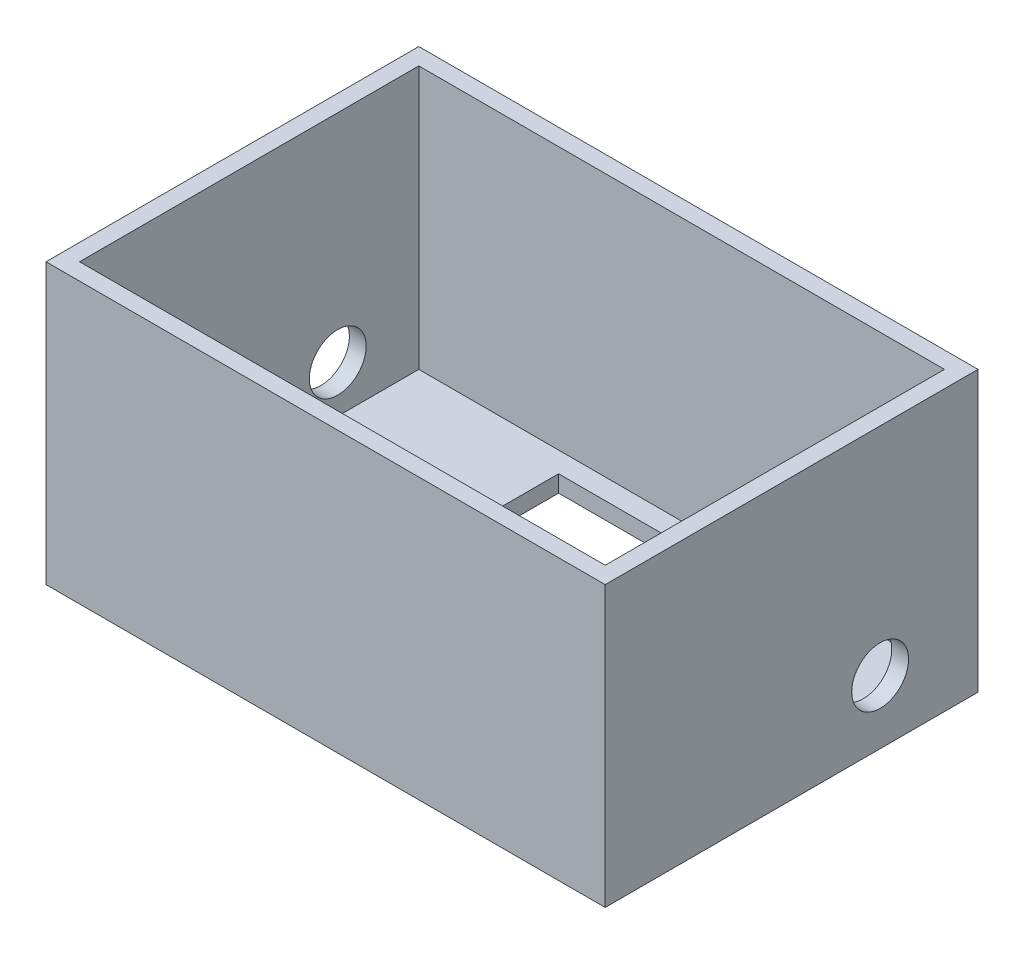
ISO-10303-21;
HEADER;
FILE_DESCRIPTION(('STEP AP214'),'2;1');
FILE_NAME('part.step','',(''),(''),'','','');
FILE_SCHEMA(('AUTOMOTIVE_DESIGN { 1 0 10303 214 1 1 1 1 }'));
ENDSEC;
DATA;
#1=APPLICATION_CONTEXT('core data for automotive mechanical design processes');
#2=APPLICATION_PROTOCOL_DEFINITION('international standard','automotive_design',2000,#1);
#3=PRODUCT_CONTEXT('',#1,'mechanical');
#4=PRODUCT('Part','Part','',(#3));
#5=PRODUCT_RELATED_PRODUCT_CATEGORY('part','',(#4));
#6=PRODUCT_DEFINITION_FORMATION('','',#4);
#7=PRODUCT_DEFINITION_CONTEXT('part definition',#1,'design');
#8=PRODUCT_DEFINITION('design','',#6,#7);
#9=PRODUCT_DEFINITION_SHAPE('','',#8);
#10=(LENGTH_UNIT() NAMED_UNIT(*) SI_UNIT(.MILLI.,.METRE.));
#11=(NAMED_UNIT(*) PLANE_ANGLE_UNIT() SI_UNIT($,.RADIAN.));
#12=(NAMED_UNIT(*) SI_UNIT($,.STERADIAN.) SOLID_ANGLE_UNIT());
#13=UNCERTAINTY_MEASURE_WITH_UNIT(LENGTH_MEASURE(1.E-05),#10,'distance_accuracy_value','');
#14=(GEOMETRIC_REPRESENTATION_CONTEXT(3) GLOBAL_UNCERTAINTY_ASSIGNED_CONTEXT((#13)) GLOBAL_UNIT_ASSIGNED_CONTEXT((#10,
#11,#12)) REPRESENTATION_CONTEXT('',''));
#15=CARTESIAN_POINT('',(0.,0.,0.));
#16=DIRECTION('',(0.,0.,1.));
#17=DIRECTION('',(1.,0.,0.));
#18=AXIS2_PLACEMENT_3D('',#15,#16,#17);
#19=CARTESIAN_POINT('',(0.,30.,0.));
#20=DIRECTION('',(0.,1.,0.));
#21=DIRECTION('',(0.,0.,1.));
#22=AXIS2_PLACEMENT_3D('',#19,#20,#21);
#23=PLANE('',#22);
#24=DIRECTION('',(1.,0.,0.));
#25=VECTOR('',#24,1.);
#26=CARTESIAN_POINT('',(0.,30.,-40.));
#27=LINE('',#26,#25);
#28=CARTESIAN_POINT('',(0.,30.,-40.));
#29=VERTEX_POINT('',#28);
#30=CARTESIAN_POINT('',(60.,30.,-40.));
#31=VERTEX_POINT('',#30);
#32=EDGE_CURVE('E186',#29,#31,#27,.T.);
#33=ORIENTED_EDGE('',*,*,#32,.F.);
#34=DIRECTION('',(0.,0.,-1.));
#35=VECTOR('',#34,1.);
#36=CARTESIAN_POINT('',(0.,30.,0.));
#37=LINE('',#36,#35);
#38=CARTESIAN_POINT('',(0.,30.,0.));
#39=VERTEX_POINT('',#38);
#40=EDGE_CURVE('E194',#39,#29,#37,.T.);
#41=ORIENTED_EDGE('',*,*,#40,.F.);
#42=DIRECTION('',(1.,0.,0.));
#43=VECTOR('',#42,1.);
#44=CARTESIAN_POINT('',(0.,30.,0.));
#45=LINE('',#44,#43);
#46=CARTESIAN_POINT('',(60.,30.,0.));
#47=VERTEX_POINT('',#46);
#48=EDGE_CURVE('E192',#39,#47,#45,.T.);
#49=ORIENTED_EDGE('',*,*,#48,.T.);
#50=DIRECTION('',(0.,0.,-1.));
#51=VECTOR('',#50,1.);
#52=CARTESIAN_POINT('',(60.,30.,0.));
#53=LINE('',#52,#51);
#54=EDGE_CURVE('E189',#47,#31,#53,.T.);
#55=ORIENTED_EDGE('',*,*,#54,.T.);
#56=EDGE_LOOP('',(#33,#41,#49,#55));
#57=FACE_BOUND('',#56,.T.);
#58=DIRECTION('',(0.,0.,-1.));
#59=VECTOR('',#58,1.);
#60=CARTESIAN_POINT('',(1.8,30.,0.));
#61=LINE('',#60,#59);
#62=CARTESIAN_POINT('',(1.8,30.,-1.8));
#63=VERTEX_POINT('',#62);
#64=CARTESIAN_POINT('',(1.79999999999999,30.,-38.2));
#65=VERTEX_POINT('',#64);
#66=EDGE_CURVE('E165',#63,#65,#61,.T.);
#67=ORIENTED_EDGE('',*,*,#66,.T.);
#68=DIRECTION('',(1.,0.,0.));
#69=VECTOR('',#68,1.);
#70=CARTESIAN_POINT('',(0.,30.,-38.2));
#71=LINE('',#70,#69);
#72=CARTESIAN_POINT('',(58.2,30.,-38.2));
#73=VERTEX_POINT('',#72);
#74=EDGE_CURVE('E169',#65,#73,#71,.T.);
#75=ORIENTED_EDGE('',*,*,#74,.T.);
#76=DIRECTION('',(0.,0.,-1.));
#77=VECTOR('',#76,1.);
#78=CARTESIAN_POINT('',(58.2,30.,0.));
#79=LINE('',#78,#77);
#80=CARTESIAN_POINT('',(58.2,30.,-1.8));
#81=VERTEX_POINT('',#80);
#82=EDGE_CURVE('E179',#81,#73,#79,.T.);
#83=ORIENTED_EDGE('',*,*,#82,.F.);
#84=DIRECTION('',(1.,0.,0.));
#85=VECTOR('',#84,1.);
#86=CARTESIAN_POINT('',(0.,30.,-1.8));
#87=LINE('',#86,#85);
#88=EDGE_CURVE('E182',#63,#81,#87,.T.);
#89=ORIENTED_EDGE('',*,*,#88,.F.);
#90=EDGE_LOOP('',(#67,#75,#83,#89));
#91=FACE_BOUND('',#90,.T.);
#92=ADVANCED_FACE('F33',(#57,#91),#23,.T.);
#93=CARTESIAN_POINT('',(0.,30.,-40.));
#94=DIRECTION('',(0.,0.,-1.));
#95=DIRECTION('',(-1.,0.,0.));
#96=AXIS2_PLACEMENT_3D('',#93,#94,#95);
#97=PLANE('',#96);
#98=DIRECTION('',(1.,0.,0.));
#99=VECTOR('',#98,1.);
#100=CARTESIAN_POINT('',(0.,0.,-40.));
#101=LINE('',#100,#99);
#102=CARTESIAN_POINT('',(0.,0.,-40.));
#103=VERTEX_POINT('',#102);
#104=CARTESIAN_POINT('',(60.,0.,-40.));
#105=VERTEX_POINT('',#104);
#106=EDGE_CURVE('E160',#103,#105,#101,.T.);
#107=ORIENTED_EDGE('',*,*,#106,.F.);
#108=DIRECTION('',(0.,-1.,0.));
#109=VECTOR('',#108,1.);
#110=CARTESIAN_POINT('',(0.,30.,-40.));
#111=LINE('',#110,#109);
#112=EDGE_CURVE('E207',#29,#103,#111,.T.);
#113=ORIENTED_EDGE('',*,*,#112,.F.);
#114=ORIENTED_EDGE('',*,*,#32,.T.);
#115=DIRECTION('',(0.,-1.,0.));
#116=VECTOR('',#115,1.);
#117=CARTESIAN_POINT('',(60.,30.,-40.));
#118=LINE('',#117,#116);
#119=EDGE_CURVE('E197',#31,#105,#118,.T.);
#120=ORIENTED_EDGE('',*,*,#119,.T.);
#121=EDGE_LOOP('',(#107,#113,#114,#120));
#122=FACE_BOUND('',#121,.T.);
#123=ADVANCED_FACE('F35',(#122),#97,.T.);
#124=CARTESIAN_POINT('',(0.,30.,0.));
#125=DIRECTION('',(-1.,0.,0.));
#126=DIRECTION('',(0.,0.,1.));
#127=AXIS2_PLACEMENT_3D('',#124,#125,#126);
#128=PLANE('',#127);
#129=CARTESIAN_POINT('',(0.,6.8,-29.5));
#130=DIRECTION('',(-1.,0.,0.));
#131=DIRECTION('',(0.,0.,1.));
#132=AXIS2_PLACEMENT_3D('',#129,#130,#131);
#133=CIRCLE('',#132,3.04999999999999);
#134=CARTESIAN_POINT('',(0.,6.8,-26.45));
#135=VERTEX_POINT('',#134);
#136=EDGE_CURVE('E279',#135,#135,#133,.T.);
#137=ORIENTED_EDGE('',*,*,#136,.F.);
#138=EDGE_LOOP('',(#137));
#139=FACE_BOUND('',#138,.T.);
#140=DIRECTION('',(0.,0.,-1.));
#141=VECTOR('',#140,1.);
#142=CARTESIAN_POINT('',(0.,0.,0.));
#143=LINE('',#142,#141);
#144=CARTESIAN_POINT('',(0.,0.,0.));
#145=VERTEX_POINT('',#144);
#146=EDGE_CURVE('E190',#145,#103,#143,.T.);
#147=ORIENTED_EDGE('',*,*,#146,.F.);
#148=DIRECTION('',(0.,-1.,0.));
#149=VECTOR('',#148,1.);
#150=CARTESIAN_POINT('',(0.,30.,0.));
#151=LINE('',#150,#149);
#152=EDGE_CURVE('E210',#39,#145,#151,.T.);
#153=ORIENTED_EDGE('',*,*,#152,.F.);
#154=ORIENTED_EDGE('',*,*,#40,.T.);
#155=ORIENTED_EDGE('',*,*,#112,.T.);
#156=EDGE_LOOP('',(#147,#153,#154,#155));
#157=FACE_BOUND('',#156,.T.);
#158=ADVANCED_FACE('F243',(#139,#157),#128,.T.);
#159=CARTESIAN_POINT('',(0.,30.,0.));
#160=DIRECTION('',(0.,0.,-1.));
#161=DIRECTION('',(-1.,0.,0.));
#162=AXIS2_PLACEMENT_3D('',#159,#160,#161);
#163=PLANE('',#162);
#164=DIRECTION('',(1.,0.,0.));
#165=VECTOR('',#164,1.);
#166=CARTESIAN_POINT('',(0.,0.,0.));
#167=LINE('',#166,#165);
#168=CARTESIAN_POINT('',(60.,0.,0.));
#169=VERTEX_POINT('',#168);
#170=EDGE_CURVE('E203',#145,#169,#167,.T.);
#171=ORIENTED_EDGE('',*,*,#170,.T.);
#172=DIRECTION('',(0.,-1.,0.));
#173=VECTOR('',#172,1.);
#174=CARTESIAN_POINT('',(60.,30.,0.));
#175=LINE('',#174,#173);
#176=EDGE_CURVE('E212',#47,#169,#175,.T.);
#177=ORIENTED_EDGE('',*,*,#176,.F.);
#178=ORIENTED_EDGE('',*,*,#48,.F.);
#179=ORIENTED_EDGE('',*,*,#152,.T.);
#180=EDGE_LOOP('',(#171,#177,#178,#179));
#181=FACE_BOUND('',#180,.T.);
#182=ADVANCED_FACE('F256',(#181),#163,.F.);
#183=CARTESIAN_POINT('',(60.,30.,0.));
#184=DIRECTION('',(-1.,0.,0.));
#185=DIRECTION('',(0.,0.,1.));
#186=AXIS2_PLACEMENT_3D('',#183,#184,#185);
#187=PLANE('',#186);
#188=CARTESIAN_POINT('',(60.,6.8,-29.5));
#189=DIRECTION('',(-1.,0.,0.));
#190=DIRECTION('',(0.,0.,1.));
#191=AXIS2_PLACEMENT_3D('',#188,#189,#190);
#192=CIRCLE('',#191,3.04999999999998);
#193=CARTESIAN_POINT('',(60.,6.8,-26.45));
#194=VERTEX_POINT('',#193);
#195=EDGE_CURVE('E267',#194,#194,#192,.T.);
#196=ORIENTED_EDGE('',*,*,#195,.T.);
#197=EDGE_LOOP('',(#196));
#198=FACE_BOUND('',#197,.T.);
#199=DIRECTION('',(0.,0.,-1.));
#200=VECTOR('',#199,1.);
#201=CARTESIAN_POINT('',(60.,0.,0.));
#202=LINE('',#201,#200);
#203=EDGE_CURVE('E200',#169,#105,#202,.T.);
#204=ORIENTED_EDGE('',*,*,#203,.T.);
#205=ORIENTED_EDGE('',*,*,#119,.F.);
#206=ORIENTED_EDGE('',*,*,#54,.F.);
#207=ORIENTED_EDGE('',*,*,#176,.T.);
#208=EDGE_LOOP('',(#204,#205,#206,#207));
#209=FACE_BOUND('',#208,.T.);
#210=ADVANCED_FACE('F253',(#198,#209),#187,.F.);
#211=CARTESIAN_POINT('',(0.,0.,0.));
#212=DIRECTION('',(0.,1.,0.));
#213=DIRECTION('',(0.,0.,1.));
#214=AXIS2_PLACEMENT_3D('',#211,#212,#213);
#215=PLANE('',#214);
#216=DIRECTION('',(-1.,0.,0.));
#217=VECTOR('',#216,1.);
#218=CARTESIAN_POINT('',(0.,0.,-36.));
#219=LINE('',#218,#217);
#220=CARTESIAN_POINT('',(41.,0.,-36.));
#221=VERTEX_POINT('',#220);
#222=CARTESIAN_POINT('',(19.,0.,-36.));
#223=VERTEX_POINT('',#222);
#224=EDGE_CURVE('E141',#221,#223,#219,.T.);
#225=ORIENTED_EDGE('',*,*,#224,.T.);
#226=DIRECTION('',(0.,0.,-1.));
#227=VECTOR('',#226,1.);
#228=CARTESIAN_POINT('',(19.,0.,0.));
#229=LINE('',#228,#227);
#230=CARTESIAN_POINT('',(19.,0.,-23.));
#231=VERTEX_POINT('',#230);
#232=EDGE_CURVE('E48',#231,#223,#229,.T.);
#233=ORIENTED_EDGE('',*,*,#232,.F.);
#234=DIRECTION('',(-1.,0.,0.));
#235=VECTOR('',#234,1.);
#236=CARTESIAN_POINT('',(0.,0.,-23.));
#237=LINE('',#236,#235);
#238=CARTESIAN_POINT('',(41.,0.,-23.));
#239=VERTEX_POINT('',#238);
#240=EDGE_CURVE('E130',#239,#231,#237,.T.);
#241=ORIENTED_EDGE('',*,*,#240,.F.);
#242=DIRECTION('',(0.,0.,-1.));
#243=VECTOR('',#242,1.);
#244=CARTESIAN_POINT('',(41.,0.,0.));
#245=LINE('',#244,#243);
#246=EDGE_CURVE('E136',#239,#221,#245,.T.);
#247=ORIENTED_EDGE('',*,*,#246,.T.);
#248=EDGE_LOOP('',(#225,#233,#241,#247));
#249=FACE_BOUND('',#248,.T.);
#250=ORIENTED_EDGE('',*,*,#106,.T.);
#251=ORIENTED_EDGE('',*,*,#203,.F.);
#252=ORIENTED_EDGE('',*,*,#170,.F.);
#253=ORIENTED_EDGE('',*,*,#146,.T.);
#254=EDGE_LOOP('',(#250,#251,#252,#253));
#255=FACE_BOUND('',#254,.T.);
#256=ADVANCED_FACE('F139',(#249,#255),#215,.F.);
#257=CARTESIAN_POINT('',(0.,30.,-38.2));
#258=DIRECTION('',(0.,0.,-1.));
#259=DIRECTION('',(-1.,0.,0.));
#260=AXIS2_PLACEMENT_3D('',#257,#258,#259);
#261=PLANE('',#260);
#262=DIRECTION('',(1.,0.,0.));
#263=VECTOR('',#262,1.);
#264=CARTESIAN_POINT('',(0.,1.8,-38.2));
#265=LINE('',#264,#263);
#266=CARTESIAN_POINT('',(1.79999999999999,1.8,-38.2));
#267=VERTEX_POINT('',#266);
#268=CARTESIAN_POINT('',(58.2,1.8,-38.2));
#269=VERTEX_POINT('',#268);
#270=EDGE_CURVE('E126',#267,#269,#265,.T.);
#271=ORIENTED_EDGE('',*,*,#270,.T.);
#272=DIRECTION('',(0.,-1.,0.));
#273=VECTOR('',#272,1.);
#274=CARTESIAN_POINT('',(58.2,30.,-38.2));
#275=LINE('',#274,#273);
#276=EDGE_CURVE('E162',#73,#269,#275,.T.);
#277=ORIENTED_EDGE('',*,*,#276,.F.);
#278=ORIENTED_EDGE('',*,*,#74,.F.);
#279=DIRECTION('',(0.,-1.,0.));
#280=VECTOR('',#279,1.);
#281=CARTESIAN_POINT('',(1.79999999999999,30.,-38.2));
#282=LINE('',#281,#280);
#283=EDGE_CURVE('E158',#65,#267,#282,.T.);
#284=ORIENTED_EDGE('',*,*,#283,.T.);
#285=EDGE_LOOP('',(#271,#277,#278,#284));
#286=FACE_BOUND('',#285,.T.);
#287=ADVANCED_FACE('F252',(#286),#261,.F.);
#288=CARTESIAN_POINT('',(1.8,30.,0.));
#289=DIRECTION('',(-1.,0.,0.));
#290=DIRECTION('',(0.,0.,1.));
#291=AXIS2_PLACEMENT_3D('',#288,#289,#290);
#292=PLANE('',#291);
#293=CARTESIAN_POINT('',(1.79999999999999,6.8,-29.5));
#294=DIRECTION('',(-1.,0.,0.));
#295=DIRECTION('',(0.,0.,1.));
#296=AXIS2_PLACEMENT_3D('',#293,#294,#295);
#297=CIRCLE('',#296,3.04999999999999);
#298=CARTESIAN_POINT('',(1.79999999999999,6.8,-26.45));
#299=VERTEX_POINT('',#298);
#300=EDGE_CURVE('E145',#299,#299,#297,.T.);
#301=ORIENTED_EDGE('',*,*,#300,.T.);
#302=EDGE_LOOP('',(#301));
#303=FACE_BOUND('',#302,.T.);
#304=DIRECTION('',(0.,0.,-1.));
#305=VECTOR('',#304,1.);
#306=CARTESIAN_POINT('',(1.8,1.8,0.));
#307=LINE('',#306,#305);
#308=CARTESIAN_POINT('',(1.8,1.8,-1.8));
#309=VERTEX_POINT('',#308);
#310=EDGE_CURVE('E166',#309,#267,#307,.T.);
#311=ORIENTED_EDGE('',*,*,#310,.T.);
#312=ORIENTED_EDGE('',*,*,#283,.F.);
#313=ORIENTED_EDGE('',*,*,#66,.F.);
#314=DIRECTION('',(0.,-1.,0.));
#315=VECTOR('',#314,1.);
#316=CARTESIAN_POINT('',(1.8,30.,-1.8));
#317=LINE('',#316,#315);
#318=EDGE_CURVE('E161',#63,#309,#317,.T.);
#319=ORIENTED_EDGE('',*,*,#318,.T.);
#320=EDGE_LOOP('',(#311,#312,#313,#319));
#321=FACE_BOUND('',#320,.T.);
#322=ADVANCED_FACE('F288',(#303,#321),#292,.F.);
#323=CARTESIAN_POINT('',(0.,30.,-1.8));
#324=DIRECTION('',(0.,0.,-1.));
#325=DIRECTION('',(-1.,0.,0.));
#326=AXIS2_PLACEMENT_3D('',#323,#324,#325);
#327=PLANE('',#326);
#328=DIRECTION('',(1.,0.,0.));
#329=VECTOR('',#328,1.);
#330=CARTESIAN_POINT('',(0.,1.8,-1.8));
#331=LINE('',#330,#329);
#332=CARTESIAN_POINT('',(58.2,1.8,-1.8));
#333=VERTEX_POINT('',#332);
#334=EDGE_CURVE('E170',#309,#333,#331,.T.);
#335=ORIENTED_EDGE('',*,*,#334,.F.);
#336=ORIENTED_EDGE('',*,*,#318,.F.);
#337=ORIENTED_EDGE('',*,*,#88,.T.);
#338=DIRECTION('',(0.,-1.,0.));
#339=VECTOR('',#338,1.);
#340=CARTESIAN_POINT('',(58.2,30.,-1.8));
#341=LINE('',#340,#339);
#342=EDGE_CURVE('E164',#81,#333,#341,.T.);
#343=ORIENTED_EDGE('',*,*,#342,.T.);
#344=EDGE_LOOP('',(#335,#336,#337,#343));
#345=FACE_BOUND('',#344,.T.);
#346=ADVANCED_FACE('F291',(#345),#327,.T.);
#347=CARTESIAN_POINT('',(58.2,30.,0.));
#348=DIRECTION('',(-1.,0.,0.));
#349=DIRECTION('',(0.,0.,1.));
#350=AXIS2_PLACEMENT_3D('',#347,#348,#349);
#351=PLANE('',#350);
#352=CARTESIAN_POINT('',(58.2,6.8,-29.5));
#353=DIRECTION('',(-1.,0.,0.));
#354=DIRECTION('',(0.,0.,1.));
#355=AXIS2_PLACEMENT_3D('',#352,#353,#354);
#356=CIRCLE('',#355,3.04999999999999);
#357=CARTESIAN_POINT('',(58.2,6.8,-26.45));
#358=VERTEX_POINT('',#357);
#359=EDGE_CURVE('E142',#358,#358,#356,.T.);
#360=ORIENTED_EDGE('',*,*,#359,.F.);
#361=EDGE_LOOP('',(#360));
#362=FACE_BOUND('',#361,.T.);
#363=DIRECTION('',(0.,0.,-1.));
#364=VECTOR('',#363,1.);
#365=CARTESIAN_POINT('',(58.2,1.8,0.));
#366=LINE('',#365,#364);
#367=EDGE_CURVE('E157',#333,#269,#366,.T.);
#368=ORIENTED_EDGE('',*,*,#367,.F.);
#369=ORIENTED_EDGE('',*,*,#342,.F.);
#370=ORIENTED_EDGE('',*,*,#82,.T.);
#371=ORIENTED_EDGE('',*,*,#276,.T.);
#372=EDGE_LOOP('',(#368,#369,#370,#371));
#373=FACE_BOUND('',#372,.T.);
#374=ADVANCED_FACE('F305',(#362,#373),#351,.T.);
#375=CARTESIAN_POINT('',(0.,1.8,0.));
#376=DIRECTION('',(0.,1.,0.));
#377=DIRECTION('',(0.,0.,1.));
#378=AXIS2_PLACEMENT_3D('',#375,#376,#377);
#379=PLANE('',#378);
#380=DIRECTION('',(0.,0.,1.));
#381=VECTOR('',#380,1.);
#382=CARTESIAN_POINT('',(19.,1.8,0.));
#383=LINE('',#382,#381);
#384=CARTESIAN_POINT('',(19.,1.8,-36.));
#385=VERTEX_POINT('',#384);
#386=CARTESIAN_POINT('',(19.,1.8,-23.));
#387=VERTEX_POINT('',#386);
#388=EDGE_CURVE('E11',#385,#387,#383,.T.);
#389=ORIENTED_EDGE('',*,*,#388,.F.);
#390=DIRECTION('',(1.,0.,0.));
#391=VECTOR('',#390,1.);
#392=CARTESIAN_POINT('',(0.,1.8,-36.));
#393=LINE('',#392,#391);
#394=CARTESIAN_POINT('',(41.,1.8,-36.));
#395=VERTEX_POINT('',#394);
#396=EDGE_CURVE('E209',#385,#395,#393,.T.);
#397=ORIENTED_EDGE('',*,*,#396,.T.);
#398=DIRECTION('',(0.,0.,1.));
#399=VECTOR('',#398,1.);
#400=CARTESIAN_POINT('',(41.,1.8,0.));
#401=LINE('',#400,#399);
#402=CARTESIAN_POINT('',(41.,1.8,-23.));
#403=VERTEX_POINT('',#402);
#404=EDGE_CURVE('E218',#395,#403,#401,.T.);
#405=ORIENTED_EDGE('',*,*,#404,.T.);
#406=DIRECTION('',(1.,0.,0.));
#407=VECTOR('',#406,1.);
#408=CARTESIAN_POINT('',(0.,1.8,-23.));
#409=LINE('',#408,#407);
#410=EDGE_CURVE('E41',#387,#403,#409,.T.);
#411=ORIENTED_EDGE('',*,*,#410,.F.);
#412=EDGE_LOOP('',(#389,#397,#405,#411));
#413=FACE_BOUND('',#412,.T.);
#414=ORIENTED_EDGE('',*,*,#270,.F.);
#415=ORIENTED_EDGE('',*,*,#310,.F.);
#416=ORIENTED_EDGE('',*,*,#334,.T.);
#417=ORIENTED_EDGE('',*,*,#367,.T.);
#418=EDGE_LOOP('',(#414,#415,#416,#417));
#419=FACE_BOUND('',#418,.T.);
#420=ADVANCED_FACE('F223',(#413,#419),#379,.T.);
#421=CARTESIAN_POINT('',(19.,30.,0.));
#422=DIRECTION('',(-1.,0.,0.));
#423=DIRECTION('',(0.,0.,1.));
#424=AXIS2_PLACEMENT_3D('',#421,#422,#423);
#425=PLANE('',#424);
#426=ORIENTED_EDGE('',*,*,#388,.T.);
#427=DIRECTION('',(0.,-1.,0.));
#428=VECTOR('',#427,1.);
#429=CARTESIAN_POINT('',(19.,30.,-23.));
#430=LINE('',#429,#428);
#431=EDGE_CURVE('E120',#387,#231,#430,.T.);
#432=ORIENTED_EDGE('',*,*,#431,.T.);
#433=ORIENTED_EDGE('',*,*,#232,.T.);
#434=DIRECTION('',(0.,-1.,0.));
#435=VECTOR('',#434,1.);
#436=CARTESIAN_POINT('',(19.,30.,-36.));
#437=LINE('',#436,#435);
#438=EDGE_CURVE('E151',#385,#223,#437,.T.);
#439=ORIENTED_EDGE('',*,*,#438,.F.);
#440=EDGE_LOOP('',(#426,#432,#433,#439));
#441=FACE_BOUND('',#440,.T.);
#442=ADVANCED_FACE('F122',(#441),#425,.F.);
#443=CARTESIAN_POINT('',(0.,30.,-23.));
#444=DIRECTION('',(0.,0.,1.));
#445=DIRECTION('',(1.,0.,0.));
#446=AXIS2_PLACEMENT_3D('',#443,#444,#445);
#447=PLANE('',#446);
#448=ORIENTED_EDGE('',*,*,#410,.T.);
#449=DIRECTION('',(0.,-1.,0.));
#450=VECTOR('',#449,1.);
#451=CARTESIAN_POINT('',(41.,30.,-23.));
#452=LINE('',#451,#450);
#453=EDGE_CURVE('E127',#403,#239,#452,.T.);
#454=ORIENTED_EDGE('',*,*,#453,.T.);
#455=ORIENTED_EDGE('',*,*,#240,.T.);
#456=ORIENTED_EDGE('',*,*,#431,.F.);
#457=EDGE_LOOP('',(#448,#454,#455,#456));
#458=FACE_BOUND('',#457,.T.);
#459=ADVANCED_FACE('F131',(#458),#447,.F.);
#460=CARTESIAN_POINT('',(41.,30.,0.));
#461=DIRECTION('',(-1.,0.,0.));
#462=DIRECTION('',(0.,0.,1.));
#463=AXIS2_PLACEMENT_3D('',#460,#461,#462);
#464=PLANE('',#463);
#465=DIRECTION('',(0.,-1.,0.));
#466=VECTOR('',#465,1.);
#467=CARTESIAN_POINT('',(41.,30.,-36.));
#468=LINE('',#467,#466);
#469=EDGE_CURVE('E56',#395,#221,#468,.T.);
#470=ORIENTED_EDGE('',*,*,#469,.T.);
#471=ORIENTED_EDGE('',*,*,#246,.F.);
#472=ORIENTED_EDGE('',*,*,#453,.F.);
#473=ORIENTED_EDGE('',*,*,#404,.F.);
#474=EDGE_LOOP('',(#470,#471,#472,#473));
#475=FACE_BOUND('',#474,.T.);
#476=ADVANCED_FACE('F222',(#475),#464,.T.);
#477=CARTESIAN_POINT('',(0.,30.,-36.));
#478=DIRECTION('',(0.,0.,1.));
#479=DIRECTION('',(1.,0.,0.));
#480=AXIS2_PLACEMENT_3D('',#477,#478,#479);
#481=PLANE('',#480);
#482=ORIENTED_EDGE('',*,*,#438,.T.);
#483=ORIENTED_EDGE('',*,*,#224,.F.);
#484=ORIENTED_EDGE('',*,*,#469,.F.);
#485=ORIENTED_EDGE('',*,*,#396,.F.);
#486=EDGE_LOOP('',(#482,#483,#484,#485));
#487=FACE_BOUND('',#486,.T.);
#488=ADVANCED_FACE('F225',(#487),#481,.T.);
#489=CARTESIAN_POINT('',(0.,6.8,-29.5));
#490=DIRECTION('',(-1.,0.,0.));
#491=DIRECTION('',(0.,0.,1.));
#492=AXIS2_PLACEMENT_3D('',#489,#490,#491);
#493=CYLINDRICAL_SURFACE('',#492,3.04999999999999);
#494=ORIENTED_EDGE('',*,*,#136,.T.);
#495=EDGE_LOOP('',(#494));
#496=FACE_BOUND('',#495,.T.);
#497=ORIENTED_EDGE('',*,*,#300,.F.);
#498=EDGE_LOOP('',(#497));
#499=FACE_BOUND('',#498,.T.);
#500=ADVANCED_FACE('F227',(#496,#499),#493,.F.);
#501=ORIENTED_EDGE('',*,*,#359,.T.);
#502=EDGE_LOOP('',(#501));
#503=FACE_BOUND('',#502,.T.);
#504=ORIENTED_EDGE('',*,*,#195,.F.);
#505=EDGE_LOOP('',(#504));
#506=FACE_BOUND('',#505,.T.);
#507=ADVANCED_FACE('F233',(#503,#506),#493,.F.);
#508=CLOSED_SHELL('',(#92,#123,#158,#182,#210,#256,#287,#322,#346,#374,#420,#442,#459,#476,#488,
#500,#507));
#509=MANIFOLD_SOLID_BREP('B2',#508);
#510=ADVANCED_BREP_SHAPE_REPRESENTATION('',(#18,#509),#14);
#511=SHAPE_DEFINITION_REPRESENTATION(#9,#510);
ENDSEC;
END-ISO-10303-21;
